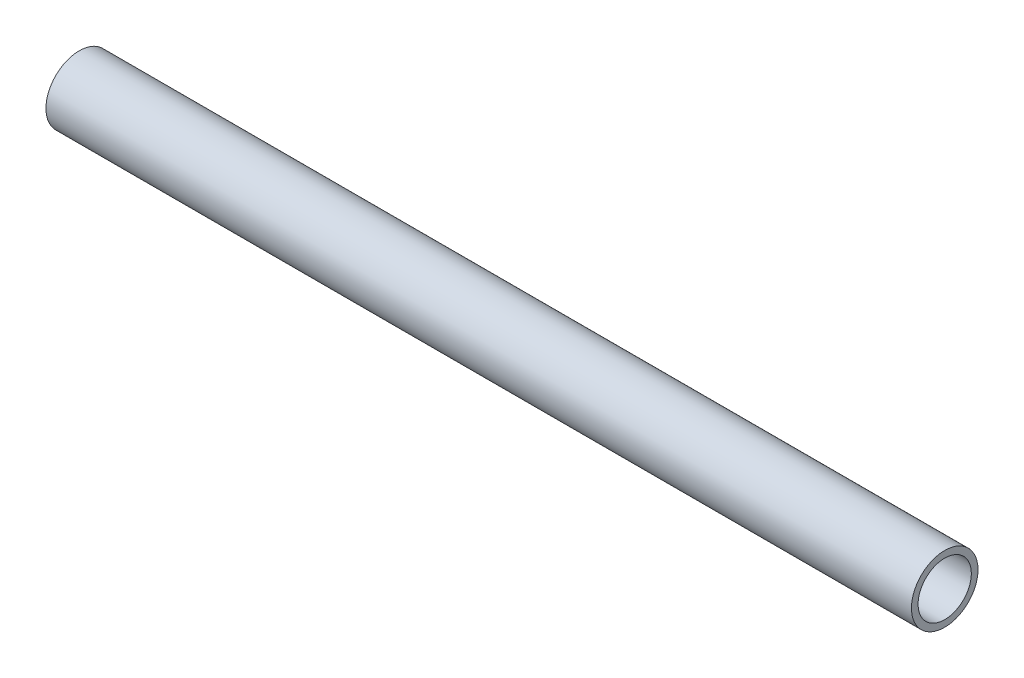
ISO-10303-21;
HEADER;
FILE_DESCRIPTION(('STEP AP214'),'2;1');
FILE_NAME('part.step','',(''),(''),'','','');
FILE_SCHEMA(('AUTOMOTIVE_DESIGN { 1 0 10303 214 1 1 1 1 }'));
ENDSEC;
DATA;
#1=APPLICATION_CONTEXT('core data for automotive mechanical design processes');
#2=APPLICATION_PROTOCOL_DEFINITION('international standard','automotive_design',2000,#1);
#3=PRODUCT_CONTEXT('',#1,'mechanical');
#4=PRODUCT('Part','Part','',(#3));
#5=PRODUCT_RELATED_PRODUCT_CATEGORY('part','',(#4));
#6=PRODUCT_DEFINITION_FORMATION('','',#4);
#7=PRODUCT_DEFINITION_CONTEXT('part definition',#1,'design');
#8=PRODUCT_DEFINITION('design','',#6,#7);
#9=PRODUCT_DEFINITION_SHAPE('','',#8);
#10=(LENGTH_UNIT() NAMED_UNIT(*) SI_UNIT(.MILLI.,.METRE.));
#11=(NAMED_UNIT(*) PLANE_ANGLE_UNIT() SI_UNIT($,.RADIAN.));
#12=(NAMED_UNIT(*) SI_UNIT($,.STERADIAN.) SOLID_ANGLE_UNIT());
#13=UNCERTAINTY_MEASURE_WITH_UNIT(LENGTH_MEASURE(1.E-05),#10,'distance_accuracy_value','');
#14=(GEOMETRIC_REPRESENTATION_CONTEXT(3) GLOBAL_UNCERTAINTY_ASSIGNED_CONTEXT((#13)) GLOBAL_UNIT_ASSIGNED_CONTEXT((#10,
#11,#12)) REPRESENTATION_CONTEXT('',''));
#15=CARTESIAN_POINT('',(0.,0.,0.));
#16=DIRECTION('',(0.,0.,1.));
#17=DIRECTION('',(1.,0.,0.));
#18=AXIS2_PLACEMENT_3D('',#15,#16,#17);
#19=CARTESIAN_POINT('',(330.2,0.,0.));
#20=DIRECTION('',(-1.,0.,0.));
#21=DIRECTION('',(0.,0.,1.));
#22=AXIS2_PLACEMENT_3D('',#19,#20,#21);
#23=CYLINDRICAL_SURFACE('',#22,10.16);
#24=CARTESIAN_POINT('',(330.2,0.,0.));
#25=DIRECTION('',(1.,0.,0.));
#26=DIRECTION('',(0.,0.,-1.));
#27=AXIS2_PLACEMENT_3D('',#24,#25,#26);
#28=CIRCLE('',#27,10.16);
#29=CARTESIAN_POINT('',(330.2,0.,-10.16));
#30=VERTEX_POINT('',#29);
#31=EDGE_CURVE('E46',#30,#30,#28,.T.);
#32=ORIENTED_EDGE('',*,*,#31,.T.);
#33=EDGE_LOOP('',(#32));
#34=FACE_BOUND('',#33,.T.);
#35=CARTESIAN_POINT('',(0.,0.,0.));
#36=DIRECTION('',(1.,0.,0.));
#37=DIRECTION('',(0.,0.,-1.));
#38=AXIS2_PLACEMENT_3D('',#35,#36,#37);
#39=CIRCLE('',#38,10.16);
#40=CARTESIAN_POINT('',(0.,0.,-10.16));
#41=VERTEX_POINT('',#40);
#42=EDGE_CURVE('E52',#41,#41,#39,.T.);
#43=ORIENTED_EDGE('',*,*,#42,.F.);
#44=EDGE_LOOP('',(#43));
#45=FACE_BOUND('',#44,.T.);
#46=ADVANCED_FACE('F39',(#34,#45),#23,.F.);
#47=CARTESIAN_POINT('',(330.2,0.,0.));
#48=DIRECTION('',(-1.,0.,0.));
#49=DIRECTION('',(0.,0.,1.));
#50=AXIS2_PLACEMENT_3D('',#47,#48,#49);
#51=CYLINDRICAL_SURFACE('',#50,12.7);
#52=CARTESIAN_POINT('',(330.2,0.,0.));
#53=DIRECTION('',(1.,0.,0.));
#54=DIRECTION('',(0.,0.,-1.));
#55=AXIS2_PLACEMENT_3D('',#52,#53,#54);
#56=CIRCLE('',#55,12.7);
#57=CARTESIAN_POINT('',(330.2,0.,-12.7));
#58=VERTEX_POINT('',#57);
#59=EDGE_CURVE('E11',#58,#58,#56,.T.);
#60=ORIENTED_EDGE('',*,*,#59,.F.);
#61=EDGE_LOOP('',(#60));
#62=FACE_BOUND('',#61,.T.);
#63=CARTESIAN_POINT('',(0.,0.,0.));
#64=DIRECTION('',(1.,0.,0.));
#65=DIRECTION('',(0.,0.,-1.));
#66=AXIS2_PLACEMENT_3D('',#63,#64,#65);
#67=CIRCLE('',#66,12.7);
#68=CARTESIAN_POINT('',(0.,0.,-12.7));
#69=VERTEX_POINT('',#68);
#70=EDGE_CURVE('E42',#69,#69,#67,.T.);
#71=ORIENTED_EDGE('',*,*,#70,.T.);
#72=EDGE_LOOP('',(#71));
#73=FACE_BOUND('',#72,.T.);
#74=ADVANCED_FACE('F59',(#62,#73),#51,.T.);
#75=CARTESIAN_POINT('',(330.2,0.,0.));
#76=DIRECTION('',(1.,0.,0.));
#77=DIRECTION('',(0.,0.,-1.));
#78=AXIS2_PLACEMENT_3D('',#75,#76,#77);
#79=PLANE('',#78);
#80=ORIENTED_EDGE('',*,*,#31,.F.);
#81=EDGE_LOOP('',(#80));
#82=FACE_BOUND('',#81,.T.);
#83=ORIENTED_EDGE('',*,*,#59,.T.);
#84=EDGE_LOOP('',(#83));
#85=FACE_BOUND('',#84,.T.);
#86=ADVANCED_FACE('F63',(#82,#85),#79,.T.);
#87=CARTESIAN_POINT('',(0.,0.,0.));
#88=DIRECTION('',(1.,0.,0.));
#89=DIRECTION('',(0.,0.,-1.));
#90=AXIS2_PLACEMENT_3D('',#87,#88,#89);
#91=PLANE('',#90);
#92=ORIENTED_EDGE('',*,*,#42,.T.);
#93=EDGE_LOOP('',(#92));
#94=FACE_BOUND('',#93,.T.);
#95=ORIENTED_EDGE('',*,*,#70,.F.);
#96=EDGE_LOOP('',(#95));
#97=FACE_BOUND('',#96,.T.);
#98=ADVANCED_FACE('F61',(#94,#97),#91,.F.);
#99=CLOSED_SHELL('',(#46,#74,#86,#98));
#100=MANIFOLD_SOLID_BREP('B2',#99);
#101=ADVANCED_BREP_SHAPE_REPRESENTATION('',(#18,#100),#14);
#102=SHAPE_DEFINITION_REPRESENTATION(#9,#101);
ENDSEC;
END-ISO-10303-21;
